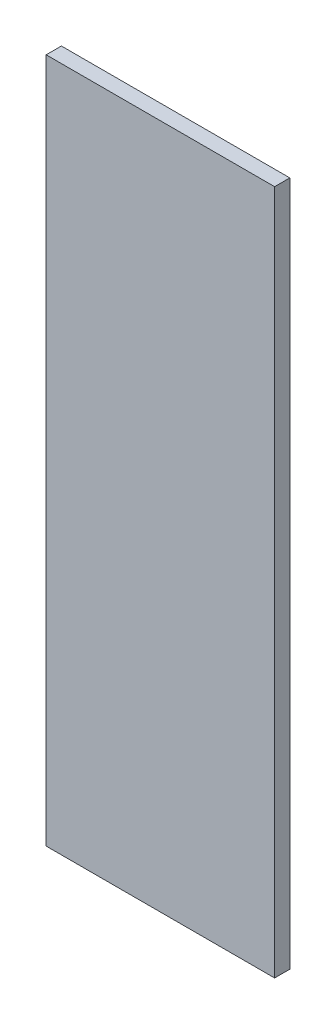
ISO-10303-21;
HEADER;
FILE_DESCRIPTION(('STEP AP214'),'2;1');
FILE_NAME('part.step','',(''),(''),'','','');
FILE_SCHEMA(('AUTOMOTIVE_DESIGN { 1 0 10303 214 1 1 1 1 }'));
ENDSEC;
DATA;
#1=APPLICATION_CONTEXT('core data for automotive mechanical design processes');
#2=APPLICATION_PROTOCOL_DEFINITION('international standard','automotive_design',2000,#1);
#3=PRODUCT_CONTEXT('',#1,'mechanical');
#4=PRODUCT('Part','Part','',(#3));
#5=PRODUCT_RELATED_PRODUCT_CATEGORY('part','',(#4));
#6=PRODUCT_DEFINITION_FORMATION('','',#4);
#7=PRODUCT_DEFINITION_CONTEXT('part definition',#1,'design');
#8=PRODUCT_DEFINITION('design','',#6,#7);
#9=PRODUCT_DEFINITION_SHAPE('','',#8);
#10=(LENGTH_UNIT() NAMED_UNIT(*) SI_UNIT(.MILLI.,.METRE.));
#11=(NAMED_UNIT(*) PLANE_ANGLE_UNIT() SI_UNIT($,.RADIAN.));
#12=(NAMED_UNIT(*) SI_UNIT($,.STERADIAN.) SOLID_ANGLE_UNIT());
#13=UNCERTAINTY_MEASURE_WITH_UNIT(LENGTH_MEASURE(1.E-05),#10,'distance_accuracy_value','');
#14=(GEOMETRIC_REPRESENTATION_CONTEXT(3) GLOBAL_UNCERTAINTY_ASSIGNED_CONTEXT((#13)) GLOBAL_UNIT_ASSIGNED_CONTEXT((#10,
#11,#12)) REPRESENTATION_CONTEXT('',''));
#15=CARTESIAN_POINT('',(0.,0.,0.));
#16=DIRECTION('',(0.,0.,1.));
#17=DIRECTION('',(1.,0.,0.));
#18=AXIS2_PLACEMENT_3D('',#15,#16,#17);
#19=CARTESIAN_POINT('',(-21.50000032037,8.15,3.5));
#20=DIRECTION('',(0.,0.,1.));
#21=DIRECTION('',(1.,0.,0.));
#22=AXIS2_PLACEMENT_3D('',#19,#20,#21);
#23=PLANE('',#22);
#24=DIRECTION('',(0.,1.,0.));
#25=VECTOR('',#24,1.);
#26=CARTESIAN_POINT('',(-23.00000034272,12.65,3.5));
#27=LINE('',#26,#25);
#28=CARTESIAN_POINT('',(-23.00000034272,12.65,3.5));
#29=VERTEX_POINT('',#28);
#30=CARTESIAN_POINT('',(-23.00000034272,3.65,3.5));
#31=VERTEX_POINT('',#30);
#32=EDGE_CURVE('E79',#29,#31,#27,.F.);
#33=ORIENTED_EDGE('',*,*,#32,.F.);
#34=DIRECTION('',(1.,0.,0.));
#35=VECTOR('',#34,1.);
#36=CARTESIAN_POINT('',(-20.00000029802,12.65,3.5));
#37=LINE('',#36,#35);
#38=CARTESIAN_POINT('',(-20.00000029802,12.65,3.5));
#39=VERTEX_POINT('',#38);
#40=EDGE_CURVE('E55',#39,#29,#37,.F.);
#41=ORIENTED_EDGE('',*,*,#40,.F.);
#42=DIRECTION('',(0.,1.,0.));
#43=VECTOR('',#42,1.);
#44=CARTESIAN_POINT('',(-20.00000029802,3.65,3.5));
#45=LINE('',#44,#43);
#46=CARTESIAN_POINT('',(-20.00000029802,3.65,3.5));
#47=VERTEX_POINT('',#46);
#48=EDGE_CURVE('E57',#47,#39,#45,.T.);
#49=ORIENTED_EDGE('',*,*,#48,.F.);
#50=DIRECTION('',(1.,0.,0.));
#51=VECTOR('',#50,1.);
#52=CARTESIAN_POINT('',(-23.00000034272,3.65,3.5));
#53=LINE('',#52,#51);
#54=EDGE_CURVE('E20',#31,#47,#53,.T.);
#55=ORIENTED_EDGE('',*,*,#54,.F.);
#56=EDGE_LOOP('',(#33,#41,#49,#55));
#57=FACE_BOUND('',#56,.T.);
#58=ADVANCED_FACE('F17',(#57),#23,.F.);
#59=CARTESIAN_POINT('',(-23.00000034272,3.65,3.5));
#60=DIRECTION('',(0.,-1.,0.));
#61=DIRECTION('',(0.,0.,-1.));
#62=AXIS2_PLACEMENT_3D('',#59,#60,#61);
#63=PLANE('',#62);
#64=DIRECTION('',(1.,0.,0.));
#65=VECTOR('',#64,1.);
#66=CARTESIAN_POINT('',(-21.50000032037,3.65,3.7));
#67=LINE('',#66,#65);
#68=CARTESIAN_POINT('',(-23.00000034272,3.65,3.7));
#69=VERTEX_POINT('',#68);
#70=CARTESIAN_POINT('',(-20.00000029802,3.65,3.7));
#71=VERTEX_POINT('',#70);
#72=EDGE_CURVE('E83',#69,#71,#67,.T.);
#73=ORIENTED_EDGE('',*,*,#72,.F.);
#74=DIRECTION('',(0.,0.,1.));
#75=VECTOR('',#74,1.);
#76=CARTESIAN_POINT('',(-23.00000034272,3.65,3.5));
#77=LINE('',#76,#75);
#78=EDGE_CURVE('E68',#31,#69,#77,.T.);
#79=ORIENTED_EDGE('',*,*,#78,.F.);
#80=ORIENTED_EDGE('',*,*,#54,.T.);
#81=DIRECTION('',(0.,0.,-1.));
#82=VECTOR('',#81,1.);
#83=CARTESIAN_POINT('',(-20.00000029802,3.65,3.5));
#84=LINE('',#83,#82);
#85=EDGE_CURVE('E63',#71,#47,#84,.T.);
#86=ORIENTED_EDGE('',*,*,#85,.F.);
#87=EDGE_LOOP('',(#73,#79,#80,#86));
#88=FACE_BOUND('',#87,.T.);
#89=ADVANCED_FACE('F65',(#88),#63,.T.);
#90=CARTESIAN_POINT('',(-20.00000029802,3.65,3.5));
#91=DIRECTION('',(1.,0.,0.));
#92=DIRECTION('',(0.,0.,-1.));
#93=AXIS2_PLACEMENT_3D('',#90,#91,#92);
#94=PLANE('',#93);
#95=DIRECTION('',(0.,1.,0.));
#96=VECTOR('',#95,1.);
#97=CARTESIAN_POINT('',(-20.00000029802,8.15,3.7));
#98=LINE('',#97,#96);
#99=CARTESIAN_POINT('',(-20.00000029802,12.65,3.7));
#100=VERTEX_POINT('',#99);
#101=EDGE_CURVE('E72',#71,#100,#98,.T.);
#102=ORIENTED_EDGE('',*,*,#101,.F.);
#103=ORIENTED_EDGE('',*,*,#85,.T.);
#104=ORIENTED_EDGE('',*,*,#48,.T.);
#105=DIRECTION('',(0.,0.,1.));
#106=VECTOR('',#105,1.);
#107=CARTESIAN_POINT('',(-20.00000029802,12.65,3.5));
#108=LINE('',#107,#106);
#109=EDGE_CURVE('E75',#100,#39,#108,.F.);
#110=ORIENTED_EDGE('',*,*,#109,.F.);
#111=EDGE_LOOP('',(#102,#103,#104,#110));
#112=FACE_BOUND('',#111,.T.);
#113=ADVANCED_FACE('F70',(#112),#94,.T.);
#114=CARTESIAN_POINT('',(-20.00000029802,12.65,3.5));
#115=DIRECTION('',(0.,1.,0.));
#116=DIRECTION('',(0.,0.,1.));
#117=AXIS2_PLACEMENT_3D('',#114,#115,#116);
#118=PLANE('',#117);
#119=DIRECTION('',(1.,0.,0.));
#120=VECTOR('',#119,1.);
#121=CARTESIAN_POINT('',(-21.50000032037,12.65,3.7));
#122=LINE('',#121,#120);
#123=CARTESIAN_POINT('',(-23.00000034272,12.65,3.7));
#124=VERTEX_POINT('',#123);
#125=EDGE_CURVE('E26',#100,#124,#122,.F.);
#126=ORIENTED_EDGE('',*,*,#125,.F.);
#127=ORIENTED_EDGE('',*,*,#109,.T.);
#128=ORIENTED_EDGE('',*,*,#40,.T.);
#129=DIRECTION('',(0.,0.,1.));
#130=VECTOR('',#129,1.);
#131=CARTESIAN_POINT('',(-23.00000034272,12.65,3.5));
#132=LINE('',#131,#130);
#133=EDGE_CURVE('E35',#124,#29,#132,.F.);
#134=ORIENTED_EDGE('',*,*,#133,.F.);
#135=EDGE_LOOP('',(#126,#127,#128,#134));
#136=FACE_BOUND('',#135,.T.);
#137=ADVANCED_FACE('F89',(#136),#118,.T.);
#138=CARTESIAN_POINT('',(-23.00000034272,12.65,3.5));
#139=DIRECTION('',(-1.,0.,0.));
#140=DIRECTION('',(0.,0.,1.));
#141=AXIS2_PLACEMENT_3D('',#138,#139,#140);
#142=PLANE('',#141);
#143=DIRECTION('',(0.,1.,0.));
#144=VECTOR('',#143,1.);
#145=CARTESIAN_POINT('',(-23.00000034272,8.15,3.7));
#146=LINE('',#145,#144);
#147=EDGE_CURVE('E11',#124,#69,#146,.F.);
#148=ORIENTED_EDGE('',*,*,#147,.F.);
#149=ORIENTED_EDGE('',*,*,#133,.T.);
#150=ORIENTED_EDGE('',*,*,#32,.T.);
#151=ORIENTED_EDGE('',*,*,#78,.T.);
#152=EDGE_LOOP('',(#148,#149,#150,#151));
#153=FACE_BOUND('',#152,.T.);
#154=ADVANCED_FACE('F91',(#153),#142,.T.);
#155=CARTESIAN_POINT('',(-21.50000032037,8.15,3.7));
#156=DIRECTION('',(0.,0.,1.));
#157=DIRECTION('',(1.,0.,0.));
#158=AXIS2_PLACEMENT_3D('',#155,#156,#157);
#159=PLANE('',#158);
#160=ORIENTED_EDGE('',*,*,#125,.T.);
#161=ORIENTED_EDGE('',*,*,#147,.T.);
#162=ORIENTED_EDGE('',*,*,#72,.T.);
#163=ORIENTED_EDGE('',*,*,#101,.T.);
#164=EDGE_LOOP('',(#160,#161,#162,#163));
#165=FACE_BOUND('',#164,.T.);
#166=ADVANCED_FACE('F88',(#165),#159,.T.);
#167=CLOSED_SHELL('',(#58,#89,#113,#137,#154,#166));
#168=MANIFOLD_SOLID_BREP('B1',#167);
#169=ADVANCED_BREP_SHAPE_REPRESENTATION('',(#18,#168),#14);
#170=SHAPE_DEFINITION_REPRESENTATION(#9,#169);
ENDSEC;
END-ISO-10303-21;
